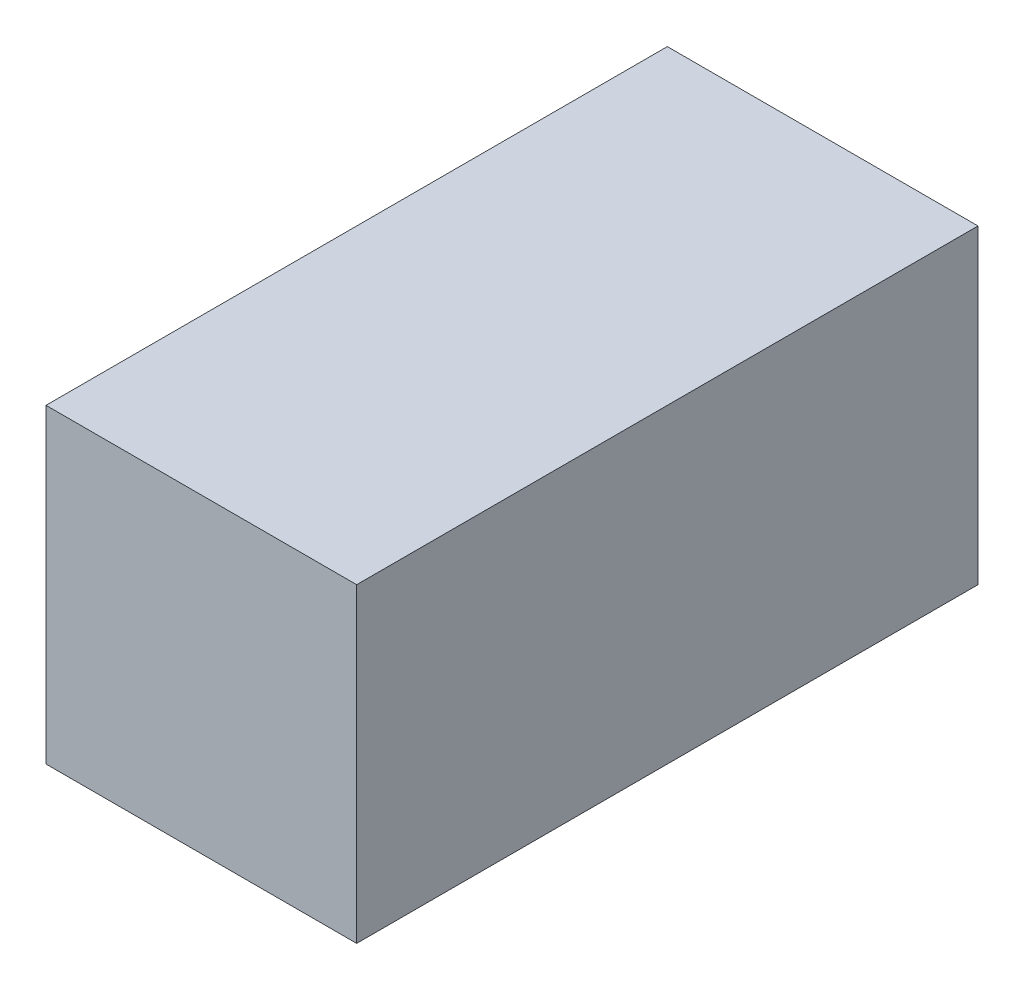
ISO-10303-21;
HEADER;
FILE_DESCRIPTION(('STEP AP214'),'2;1');
FILE_NAME('part.step','',(''),(''),'','','');
FILE_SCHEMA(('AUTOMOTIVE_DESIGN { 1 0 10303 214 1 1 1 1 }'));
ENDSEC;
DATA;
#1=APPLICATION_CONTEXT('core data for automotive mechanical design processes');
#2=APPLICATION_PROTOCOL_DEFINITION('international standard','automotive_design',2000,#1);
#3=PRODUCT_CONTEXT('',#1,'mechanical');
#4=PRODUCT('Part','Part','',(#3));
#5=PRODUCT_RELATED_PRODUCT_CATEGORY('part','',(#4));
#6=PRODUCT_DEFINITION_FORMATION('','',#4);
#7=PRODUCT_DEFINITION_CONTEXT('part definition',#1,'design');
#8=PRODUCT_DEFINITION('design','',#6,#7);
#9=PRODUCT_DEFINITION_SHAPE('','',#8);
#10=(LENGTH_UNIT() NAMED_UNIT(*) SI_UNIT(.MILLI.,.METRE.));
#11=(NAMED_UNIT(*) PLANE_ANGLE_UNIT() SI_UNIT($,.RADIAN.));
#12=(NAMED_UNIT(*) SI_UNIT($,.STERADIAN.) SOLID_ANGLE_UNIT());
#13=UNCERTAINTY_MEASURE_WITH_UNIT(LENGTH_MEASURE(1.E-05),#10,'distance_accuracy_value','');
#14=(GEOMETRIC_REPRESENTATION_CONTEXT(3) GLOBAL_UNCERTAINTY_ASSIGNED_CONTEXT((#13)) GLOBAL_UNIT_ASSIGNED_CONTEXT((#10,
#11,#12)) REPRESENTATION_CONTEXT('',''));
#15=CARTESIAN_POINT('',(0.,0.,0.));
#16=DIRECTION('',(0.,0.,1.));
#17=DIRECTION('',(1.,0.,0.));
#18=AXIS2_PLACEMENT_3D('',#15,#16,#17);
#19=CARTESIAN_POINT('',(250.,-250.,1000.));
#20=DIRECTION('',(-1.,0.,0.));
#21=DIRECTION('',(0.,0.,1.));
#22=AXIS2_PLACEMENT_3D('',#19,#20,#21);
#23=PLANE('',#22);
#24=DIRECTION('',(0.,1.,0.));
#25=VECTOR('',#24,1.);
#26=CARTESIAN_POINT('',(250.,-250.,0.));
#27=LINE('',#26,#25);
#28=CARTESIAN_POINT('',(250.,-250.,0.));
#29=VERTEX_POINT('',#28);
#30=CARTESIAN_POINT('',(250.,250.,0.));
#31=VERTEX_POINT('',#30);
#32=EDGE_CURVE('E94',#29,#31,#27,.T.);
#33=ORIENTED_EDGE('',*,*,#32,.T.);
#34=DIRECTION('',(0.,0.,-1.));
#35=VECTOR('',#34,1.);
#36=CARTESIAN_POINT('',(250.,250.,1000.));
#37=LINE('',#36,#35);
#38=CARTESIAN_POINT('',(250.,250.,1000.));
#39=VERTEX_POINT('',#38);
#40=EDGE_CURVE('E11',#39,#31,#37,.T.);
#41=ORIENTED_EDGE('',*,*,#40,.F.);
#42=DIRECTION('',(0.,1.,0.));
#43=VECTOR('',#42,1.);
#44=CARTESIAN_POINT('',(250.,-250.,1000.));
#45=LINE('',#44,#43);
#46=CARTESIAN_POINT('',(250.,-250.,1000.));
#47=VERTEX_POINT('',#46);
#48=EDGE_CURVE('E82',#47,#39,#45,.T.);
#49=ORIENTED_EDGE('',*,*,#48,.F.);
#50=DIRECTION('',(0.,0.,-1.));
#51=VECTOR('',#50,1.);
#52=CARTESIAN_POINT('',(250.,-250.,1000.));
#53=LINE('',#52,#51);
#54=EDGE_CURVE('E90',#47,#29,#53,.T.);
#55=ORIENTED_EDGE('',*,*,#54,.T.);
#56=EDGE_LOOP('',(#33,#41,#49,#55));
#57=FACE_BOUND('',#56,.T.);
#58=ADVANCED_FACE('F31',(#57),#23,.F.);
#59=CARTESIAN_POINT('',(-250.,250.,1000.));
#60=DIRECTION('',(0.,-1.,0.));
#61=DIRECTION('',(0.,0.,-1.));
#62=AXIS2_PLACEMENT_3D('',#59,#60,#61);
#63=PLANE('',#62);
#64=DIRECTION('',(-1.,0.,0.));
#65=VECTOR('',#64,1.);
#66=CARTESIAN_POINT('',(-250.,250.,0.));
#67=LINE('',#66,#65);
#68=CARTESIAN_POINT('',(-250.,250.,0.));
#69=VERTEX_POINT('',#68);
#70=EDGE_CURVE('E86',#31,#69,#67,.T.);
#71=ORIENTED_EDGE('',*,*,#70,.T.);
#72=DIRECTION('',(0.,0.,-1.));
#73=VECTOR('',#72,1.);
#74=CARTESIAN_POINT('',(-250.,250.,1000.));
#75=LINE('',#74,#73);
#76=CARTESIAN_POINT('',(-250.,250.,1000.));
#77=VERTEX_POINT('',#76);
#78=EDGE_CURVE('E39',#77,#69,#75,.T.);
#79=ORIENTED_EDGE('',*,*,#78,.F.);
#80=DIRECTION('',(-1.,0.,0.));
#81=VECTOR('',#80,1.);
#82=CARTESIAN_POINT('',(-250.,250.,1000.));
#83=LINE('',#82,#81);
#84=EDGE_CURVE('E77',#39,#77,#83,.T.);
#85=ORIENTED_EDGE('',*,*,#84,.F.);
#86=ORIENTED_EDGE('',*,*,#40,.T.);
#87=EDGE_LOOP('',(#71,#79,#85,#86));
#88=FACE_BOUND('',#87,.T.);
#89=ADVANCED_FACE('F85',(#88),#63,.F.);
#90=CARTESIAN_POINT('',(-250.,-250.,1000.));
#91=DIRECTION('',(1.,0.,0.));
#92=DIRECTION('',(0.,0.,-1.));
#93=AXIS2_PLACEMENT_3D('',#90,#91,#92);
#94=PLANE('',#93);
#95=DIRECTION('',(0.,-1.,0.));
#96=VECTOR('',#95,1.);
#97=CARTESIAN_POINT('',(-250.,-250.,0.));
#98=LINE('',#97,#96);
#99=CARTESIAN_POINT('',(-250.,-250.,0.));
#100=VERTEX_POINT('',#99);
#101=EDGE_CURVE('E64',#69,#100,#98,.T.);
#102=ORIENTED_EDGE('',*,*,#101,.T.);
#103=DIRECTION('',(0.,0.,-1.));
#104=VECTOR('',#103,1.);
#105=CARTESIAN_POINT('',(-250.,-250.,1000.));
#106=LINE('',#105,#104);
#107=CARTESIAN_POINT('',(-250.,-250.,1000.));
#108=VERTEX_POINT('',#107);
#109=EDGE_CURVE('E87',#108,#100,#106,.T.);
#110=ORIENTED_EDGE('',*,*,#109,.F.);
#111=DIRECTION('',(0.,-1.,0.));
#112=VECTOR('',#111,1.);
#113=CARTESIAN_POINT('',(-250.,-250.,1000.));
#114=LINE('',#113,#112);
#115=EDGE_CURVE('E80',#77,#108,#114,.T.);
#116=ORIENTED_EDGE('',*,*,#115,.F.);
#117=ORIENTED_EDGE('',*,*,#78,.T.);
#118=EDGE_LOOP('',(#102,#110,#116,#117));
#119=FACE_BOUND('',#118,.T.);
#120=ADVANCED_FACE('F88',(#119),#94,.F.);
#121=CARTESIAN_POINT('',(-250.,-250.,1000.));
#122=DIRECTION('',(0.,1.,0.));
#123=DIRECTION('',(0.,0.,1.));
#124=AXIS2_PLACEMENT_3D('',#121,#122,#123);
#125=PLANE('',#124);
#126=DIRECTION('',(1.,0.,0.));
#127=VECTOR('',#126,1.);
#128=CARTESIAN_POINT('',(-250.,-250.,0.));
#129=LINE('',#128,#127);
#130=EDGE_CURVE('E70',#100,#29,#129,.T.);
#131=ORIENTED_EDGE('',*,*,#130,.T.);
#132=ORIENTED_EDGE('',*,*,#54,.F.);
#133=DIRECTION('',(1.,0.,0.));
#134=VECTOR('',#133,1.);
#135=CARTESIAN_POINT('',(-250.,-250.,1000.));
#136=LINE('',#135,#134);
#137=EDGE_CURVE('E47',#108,#47,#136,.T.);
#138=ORIENTED_EDGE('',*,*,#137,.F.);
#139=ORIENTED_EDGE('',*,*,#109,.T.);
#140=EDGE_LOOP('',(#131,#132,#138,#139));
#141=FACE_BOUND('',#140,.T.);
#142=ADVANCED_FACE('F101',(#141),#125,.F.);
#143=CARTESIAN_POINT('',(250.,250.,1000.));
#144=DIRECTION('',(0.,0.,-1.));
#145=DIRECTION('',(-1.,0.,0.));
#146=AXIS2_PLACEMENT_3D('',#143,#144,#145);
#147=PLANE('',#146);
#148=ORIENTED_EDGE('',*,*,#48,.T.);
#149=ORIENTED_EDGE('',*,*,#84,.T.);
#150=ORIENTED_EDGE('',*,*,#115,.T.);
#151=ORIENTED_EDGE('',*,*,#137,.T.);
#152=EDGE_LOOP('',(#148,#149,#150,#151));
#153=FACE_BOUND('',#152,.T.);
#154=ADVANCED_FACE('F78',(#153),#147,.F.);
#155=CARTESIAN_POINT('',(250.,250.,0.));
#156=DIRECTION('',(0.,0.,-1.));
#157=DIRECTION('',(-1.,0.,0.));
#158=AXIS2_PLACEMENT_3D('',#155,#156,#157);
#159=PLANE('',#158);
#160=ORIENTED_EDGE('',*,*,#32,.F.);
#161=ORIENTED_EDGE('',*,*,#130,.F.);
#162=ORIENTED_EDGE('',*,*,#101,.F.);
#163=ORIENTED_EDGE('',*,*,#70,.F.);
#164=EDGE_LOOP('',(#160,#161,#162,#163));
#165=FACE_BOUND('',#164,.T.);
#166=ADVANCED_FACE('F104',(#165),#159,.T.);
#167=CLOSED_SHELL('',(#58,#89,#120,#142,#154,#166));
#168=MANIFOLD_SOLID_BREP('B2',#167);
#169=ADVANCED_BREP_SHAPE_REPRESENTATION('',(#18,#168),#14);
#170=SHAPE_DEFINITION_REPRESENTATION(#9,#169);
ENDSEC;
END-ISO-10303-21;
